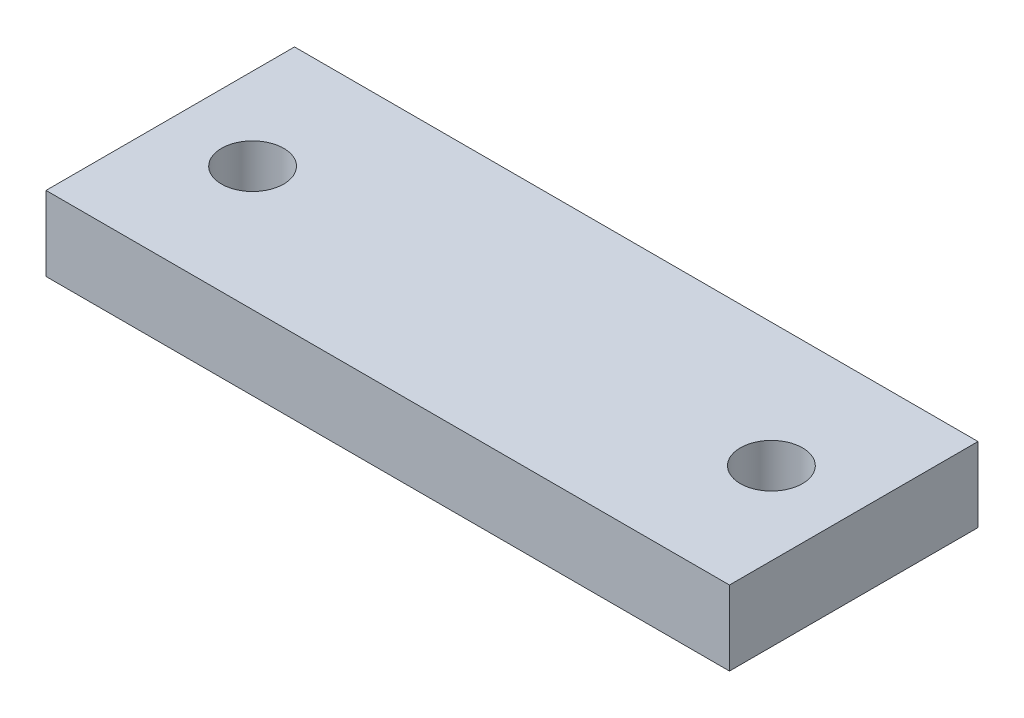
ISO-10303-21;
HEADER;
FILE_DESCRIPTION(('STEP AP214'),'2;1');
FILE_NAME('part.step','',(''),(''),'','','');
FILE_SCHEMA(('AUTOMOTIVE_DESIGN { 1 0 10303 214 1 1 1 1 }'));
ENDSEC;
DATA;
#1=APPLICATION_CONTEXT('core data for automotive mechanical design processes');
#2=APPLICATION_PROTOCOL_DEFINITION('international standard','automotive_design',2000,#1);
#3=PRODUCT_CONTEXT('',#1,'mechanical');
#4=PRODUCT('Part','Part','',(#3));
#5=PRODUCT_RELATED_PRODUCT_CATEGORY('part','',(#4));
#6=PRODUCT_DEFINITION_FORMATION('','',#4);
#7=PRODUCT_DEFINITION_CONTEXT('part definition',#1,'design');
#8=PRODUCT_DEFINITION('design','',#6,#7);
#9=PRODUCT_DEFINITION_SHAPE('','',#8);
#10=(LENGTH_UNIT() NAMED_UNIT(*) SI_UNIT(.MILLI.,.METRE.));
#11=(NAMED_UNIT(*) PLANE_ANGLE_UNIT() SI_UNIT($,.RADIAN.));
#12=(NAMED_UNIT(*) SI_UNIT($,.STERADIAN.) SOLID_ANGLE_UNIT());
#13=UNCERTAINTY_MEASURE_WITH_UNIT(LENGTH_MEASURE(1.E-05),#10,'distance_accuracy_value','');
#14=(GEOMETRIC_REPRESENTATION_CONTEXT(3) GLOBAL_UNCERTAINTY_ASSIGNED_CONTEXT((#13)) GLOBAL_UNIT_ASSIGNED_CONTEXT((#10,
#11,#12)) REPRESENTATION_CONTEXT('',''));
#15=CARTESIAN_POINT('',(0.,0.,0.));
#16=DIRECTION('',(0.,0.,1.));
#17=DIRECTION('',(1.,0.,0.));
#18=AXIS2_PLACEMENT_3D('',#15,#16,#17);
#19=CARTESIAN_POINT('',(27.5,6.,10.));
#20=DIRECTION('',(-1.,0.,0.));
#21=DIRECTION('',(0.,0.,1.));
#22=AXIS2_PLACEMENT_3D('',#19,#20,#21);
#23=PLANE('',#22);
#24=DIRECTION('',(0.,0.,-1.));
#25=VECTOR('',#24,1.);
#26=CARTESIAN_POINT('',(27.5,0.,10.));
#27=LINE('',#26,#25);
#28=CARTESIAN_POINT('',(27.5,0.,10.));
#29=VERTEX_POINT('',#28);
#30=CARTESIAN_POINT('',(27.5,0.,-10.));
#31=VERTEX_POINT('',#30);
#32=EDGE_CURVE('E118',#29,#31,#27,.T.);
#33=ORIENTED_EDGE('',*,*,#32,.T.);
#34=DIRECTION('',(0.,-1.,0.));
#35=VECTOR('',#34,1.);
#36=CARTESIAN_POINT('',(27.5,6.,-10.));
#37=LINE('',#36,#35);
#38=CARTESIAN_POINT('',(27.5,6.,-10.));
#39=VERTEX_POINT('',#38);
#40=EDGE_CURVE('E11',#39,#31,#37,.T.);
#41=ORIENTED_EDGE('',*,*,#40,.F.);
#42=DIRECTION('',(0.,0.,-1.));
#43=VECTOR('',#42,1.);
#44=CARTESIAN_POINT('',(27.5,6.,10.));
#45=LINE('',#44,#43);
#46=CARTESIAN_POINT('',(27.5,6.,10.));
#47=VERTEX_POINT('',#46);
#48=EDGE_CURVE('E102',#47,#39,#45,.T.);
#49=ORIENTED_EDGE('',*,*,#48,.F.);
#50=DIRECTION('',(0.,-1.,0.));
#51=VECTOR('',#50,1.);
#52=CARTESIAN_POINT('',(27.5,6.,10.));
#53=LINE('',#52,#51);
#54=EDGE_CURVE('E114',#47,#29,#53,.T.);
#55=ORIENTED_EDGE('',*,*,#54,.T.);
#56=EDGE_LOOP('',(#33,#41,#49,#55));
#57=FACE_BOUND('',#56,.T.);
#58=ADVANCED_FACE('F44',(#57),#23,.F.);
#59=CARTESIAN_POINT('',(-27.5,6.,-10.));
#60=DIRECTION('',(0.,0.,1.));
#61=DIRECTION('',(1.,0.,0.));
#62=AXIS2_PLACEMENT_3D('',#59,#60,#61);
#63=PLANE('',#62);
#64=DIRECTION('',(-1.,0.,0.));
#65=VECTOR('',#64,1.);
#66=CARTESIAN_POINT('',(-27.5,0.,-10.));
#67=LINE('',#66,#65);
#68=CARTESIAN_POINT('',(-27.5,0.,-10.));
#69=VERTEX_POINT('',#68);
#70=EDGE_CURVE('E107',#31,#69,#67,.T.);
#71=ORIENTED_EDGE('',*,*,#70,.T.);
#72=DIRECTION('',(0.,-1.,0.));
#73=VECTOR('',#72,1.);
#74=CARTESIAN_POINT('',(-27.5,6.,-10.));
#75=LINE('',#74,#73);
#76=CARTESIAN_POINT('',(-27.5,6.,-10.));
#77=VERTEX_POINT('',#76);
#78=EDGE_CURVE('E53',#77,#69,#75,.T.);
#79=ORIENTED_EDGE('',*,*,#78,.F.);
#80=DIRECTION('',(-1.,0.,0.));
#81=VECTOR('',#80,1.);
#82=CARTESIAN_POINT('',(-27.5,6.,-10.));
#83=LINE('',#82,#81);
#84=EDGE_CURVE('E97',#39,#77,#83,.T.);
#85=ORIENTED_EDGE('',*,*,#84,.F.);
#86=ORIENTED_EDGE('',*,*,#40,.T.);
#87=EDGE_LOOP('',(#71,#79,#85,#86));
#88=FACE_BOUND('',#87,.T.);
#89=ADVANCED_FACE('F106',(#88),#63,.F.);
#90=CARTESIAN_POINT('',(-27.5,6.,10.));
#91=DIRECTION('',(1.,0.,0.));
#92=DIRECTION('',(0.,0.,-1.));
#93=AXIS2_PLACEMENT_3D('',#90,#91,#92);
#94=PLANE('',#93);
#95=DIRECTION('',(0.,0.,1.));
#96=VECTOR('',#95,1.);
#97=CARTESIAN_POINT('',(-27.5,0.,10.));
#98=LINE('',#97,#96);
#99=CARTESIAN_POINT('',(-27.5,0.,10.));
#100=VERTEX_POINT('',#99);
#101=EDGE_CURVE('E83',#69,#100,#98,.T.);
#102=ORIENTED_EDGE('',*,*,#101,.T.);
#103=DIRECTION('',(0.,-1.,0.));
#104=VECTOR('',#103,1.);
#105=CARTESIAN_POINT('',(-27.5,6.,10.));
#106=LINE('',#105,#104);
#107=CARTESIAN_POINT('',(-27.5,6.,10.));
#108=VERTEX_POINT('',#107);
#109=EDGE_CURVE('E108',#108,#100,#106,.T.);
#110=ORIENTED_EDGE('',*,*,#109,.F.);
#111=DIRECTION('',(0.,0.,1.));
#112=VECTOR('',#111,1.);
#113=CARTESIAN_POINT('',(-27.5,6.,10.));
#114=LINE('',#113,#112);
#115=EDGE_CURVE('E100',#77,#108,#114,.T.);
#116=ORIENTED_EDGE('',*,*,#115,.F.);
#117=ORIENTED_EDGE('',*,*,#78,.T.);
#118=EDGE_LOOP('',(#102,#110,#116,#117));
#119=FACE_BOUND('',#118,.T.);
#120=ADVANCED_FACE('F109',(#119),#94,.F.);
#121=CARTESIAN_POINT('',(-27.5,6.,10.));
#122=DIRECTION('',(0.,0.,-1.));
#123=DIRECTION('',(-1.,0.,0.));
#124=AXIS2_PLACEMENT_3D('',#121,#122,#123);
#125=PLANE('',#124);
#126=DIRECTION('',(1.,0.,0.));
#127=VECTOR('',#126,1.);
#128=CARTESIAN_POINT('',(-27.5,0.,10.));
#129=LINE('',#128,#127);
#130=EDGE_CURVE('E89',#100,#29,#129,.T.);
#131=ORIENTED_EDGE('',*,*,#130,.T.);
#132=ORIENTED_EDGE('',*,*,#54,.F.);
#133=DIRECTION('',(1.,0.,0.));
#134=VECTOR('',#133,1.);
#135=CARTESIAN_POINT('',(-27.5,6.,10.));
#136=LINE('',#135,#134);
#137=EDGE_CURVE('E64',#108,#47,#136,.T.);
#138=ORIENTED_EDGE('',*,*,#137,.F.);
#139=ORIENTED_EDGE('',*,*,#109,.T.);
#140=EDGE_LOOP('',(#131,#132,#138,#139));
#141=FACE_BOUND('',#140,.T.);
#142=ADVANCED_FACE('F131',(#141),#125,.F.);
#143=CARTESIAN_POINT('',(0.,6.,0.));
#144=DIRECTION('',(0.,-1.,0.));
#145=DIRECTION('',(0.,0.,-1.));
#146=AXIS2_PLACEMENT_3D('',#143,#144,#145);
#147=PLANE('',#146);
#148=CARTESIAN_POINT('',(-20.875,6.,0.));
#149=DIRECTION('',(0.,1.,0.));
#150=DIRECTION('',(0.,0.,1.));
#151=AXIS2_PLACEMENT_3D('',#148,#149,#150);
#152=CIRCLE('',#151,2.5);
#153=CARTESIAN_POINT('',(-20.875,6.,2.5));
#154=VERTEX_POINT('',#153);
#155=EDGE_CURVE('E146',#154,#154,#152,.T.);
#156=ORIENTED_EDGE('',*,*,#155,.F.);
#157=EDGE_LOOP('',(#156));
#158=FACE_BOUND('',#157,.T.);
#159=CARTESIAN_POINT('',(20.875,6.,0.));
#160=DIRECTION('',(0.,1.,0.));
#161=DIRECTION('',(0.,0.,1.));
#162=AXIS2_PLACEMENT_3D('',#159,#160,#161);
#163=CIRCLE('',#162,2.5);
#164=CARTESIAN_POINT('',(20.875,6.,2.5));
#165=VERTEX_POINT('',#164);
#166=EDGE_CURVE('E138',#165,#165,#163,.T.);
#167=ORIENTED_EDGE('',*,*,#166,.F.);
#168=EDGE_LOOP('',(#167));
#169=FACE_BOUND('',#168,.T.);
#170=ORIENTED_EDGE('',*,*,#48,.T.);
#171=ORIENTED_EDGE('',*,*,#84,.T.);
#172=ORIENTED_EDGE('',*,*,#115,.T.);
#173=ORIENTED_EDGE('',*,*,#137,.T.);
#174=EDGE_LOOP('',(#170,#171,#172,#173));
#175=FACE_BOUND('',#174,.T.);
#176=ADVANCED_FACE('F98',(#158,#169,#175),#147,.F.);
#177=CARTESIAN_POINT('',(0.,0.,0.));
#178=DIRECTION('',(0.,-1.,0.));
#179=DIRECTION('',(0.,0.,-1.));
#180=AXIS2_PLACEMENT_3D('',#177,#178,#179);
#181=PLANE('',#180);
#182=CARTESIAN_POINT('',(-20.875,0.,0.));
#183=DIRECTION('',(0.,1.,0.));
#184=DIRECTION('',(0.,0.,1.));
#185=AXIS2_PLACEMENT_3D('',#182,#183,#184);
#186=CIRCLE('',#185,2.5);
#187=CARTESIAN_POINT('',(-20.875,0.,2.5));
#188=VERTEX_POINT('',#187);
#189=EDGE_CURVE('E122',#188,#188,#186,.T.);
#190=ORIENTED_EDGE('',*,*,#189,.T.);
#191=EDGE_LOOP('',(#190));
#192=FACE_BOUND('',#191,.T.);
#193=CARTESIAN_POINT('',(20.875,0.,0.));
#194=DIRECTION('',(0.,1.,0.));
#195=DIRECTION('',(0.,0.,1.));
#196=AXIS2_PLACEMENT_3D('',#193,#194,#195);
#197=CIRCLE('',#196,2.5);
#198=CARTESIAN_POINT('',(20.875,0.,2.5));
#199=VERTEX_POINT('',#198);
#200=EDGE_CURVE('E142',#199,#199,#197,.T.);
#201=ORIENTED_EDGE('',*,*,#200,.T.);
#202=EDGE_LOOP('',(#201));
#203=FACE_BOUND('',#202,.T.);
#204=ORIENTED_EDGE('',*,*,#32,.F.);
#205=ORIENTED_EDGE('',*,*,#130,.F.);
#206=ORIENTED_EDGE('',*,*,#101,.F.);
#207=ORIENTED_EDGE('',*,*,#70,.F.);
#208=EDGE_LOOP('',(#204,#205,#206,#207));
#209=FACE_BOUND('',#208,.T.);
#210=ADVANCED_FACE('F134',(#192,#203,#209),#181,.T.);
#211=CARTESIAN_POINT('',(20.875,0.,0.));
#212=DIRECTION('',(0.,1.,0.));
#213=DIRECTION('',(0.,0.,1.));
#214=AXIS2_PLACEMENT_3D('',#211,#212,#213);
#215=CYLINDRICAL_SURFACE('',#214,2.5);
#216=ORIENTED_EDGE('',*,*,#200,.F.);
#217=EDGE_LOOP('',(#216));
#218=FACE_BOUND('',#217,.T.);
#219=ORIENTED_EDGE('',*,*,#166,.T.);
#220=EDGE_LOOP('',(#219));
#221=FACE_BOUND('',#220,.T.);
#222=ADVANCED_FACE('F159',(#218,#221),#215,.F.);
#223=CARTESIAN_POINT('',(-20.875,0.,0.));
#224=DIRECTION('',(0.,1.,0.));
#225=DIRECTION('',(0.,0.,1.));
#226=AXIS2_PLACEMENT_3D('',#223,#224,#225);
#227=CYLINDRICAL_SURFACE('',#226,2.5);
#228=ORIENTED_EDGE('',*,*,#189,.F.);
#229=EDGE_LOOP('',(#228));
#230=FACE_BOUND('',#229,.T.);
#231=ORIENTED_EDGE('',*,*,#155,.T.);
#232=EDGE_LOOP('',(#231));
#233=FACE_BOUND('',#232,.T.);
#234=ADVANCED_FACE('F156',(#230,#233),#227,.F.);
#235=CLOSED_SHELL('',(#58,#89,#120,#142,#176,#210,#222,#234));
#236=MANIFOLD_SOLID_BREP('B2',#235);
#237=ADVANCED_BREP_SHAPE_REPRESENTATION('',(#18,#236),#14);
#238=SHAPE_DEFINITION_REPRESENTATION(#9,#237);
ENDSEC;
END-ISO-10303-21;
